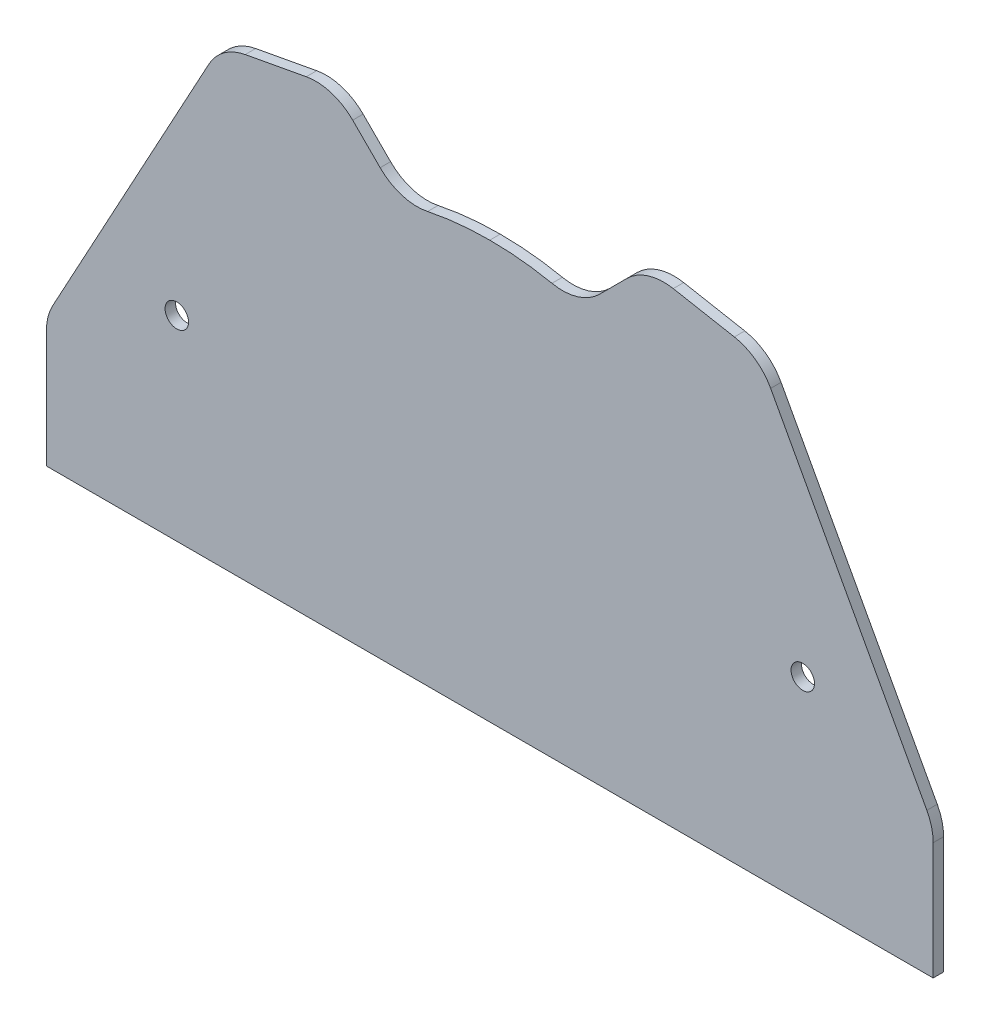
ISO-10303-21;
HEADER;
FILE_DESCRIPTION(('STEP AP214'),'2;1');
FILE_NAME('part.step','',(''),(''),'','','');
FILE_SCHEMA(('AUTOMOTIVE_DESIGN { 1 0 10303 214 1 1 1 1 }'));
ENDSEC;
DATA;
#1=APPLICATION_CONTEXT('core data for automotive mechanical design processes');
#2=APPLICATION_PROTOCOL_DEFINITION('international standard','automotive_design',2000,#1);
#3=PRODUCT_CONTEXT('',#1,'mechanical');
#4=PRODUCT('Part','Part','',(#3));
#5=PRODUCT_RELATED_PRODUCT_CATEGORY('part','',(#4));
#6=PRODUCT_DEFINITION_FORMATION('','',#4);
#7=PRODUCT_DEFINITION_CONTEXT('part definition',#1,'design');
#8=PRODUCT_DEFINITION('design','',#6,#7);
#9=PRODUCT_DEFINITION_SHAPE('','',#8);
#10=(LENGTH_UNIT() NAMED_UNIT(*) SI_UNIT(.MILLI.,.METRE.));
#11=(NAMED_UNIT(*) PLANE_ANGLE_UNIT() SI_UNIT($,.RADIAN.));
#12=(NAMED_UNIT(*) SI_UNIT($,.STERADIAN.) SOLID_ANGLE_UNIT());
#13=UNCERTAINTY_MEASURE_WITH_UNIT(LENGTH_MEASURE(1.E-05),#10,'distance_accuracy_value','');
#14=(GEOMETRIC_REPRESENTATION_CONTEXT(3) GLOBAL_UNCERTAINTY_ASSIGNED_CONTEXT((#13)) GLOBAL_UNIT_ASSIGNED_CONTEXT((#10,
#11,#12)) REPRESENTATION_CONTEXT('',''));
#15=CARTESIAN_POINT('',(0.,0.,0.));
#16=DIRECTION('',(0.,0.,1.));
#17=DIRECTION('',(1.,0.,0.));
#18=AXIS2_PLACEMENT_3D('',#15,#16,#17);
#19=CARTESIAN_POINT('',(-0.186815251095863,22.2203437074519,2.));
#20=DIRECTION('',(0.,0.,-1.));
#21=DIRECTION('',(-1.,0.,0.));
#22=AXIS2_PLACEMENT_3D('',#19,#20,#21);
#23=PLANE('',#22);
#24=CARTESIAN_POINT('',(-60.,37.5,2.));
#25=DIRECTION('',(0.,0.,1.));
#26=DIRECTION('',(1.,0.,0.));
#27=AXIS2_PLACEMENT_3D('',#24,#25,#26);
#28=CIRCLE('',#27,2.25);
#29=CARTESIAN_POINT('',(-57.75,37.5,2.));
#30=VERTEX_POINT('',#29);
#31=EDGE_CURVE('E299',#30,#30,#28,.T.);
#32=ORIENTED_EDGE('',*,*,#31,.F.);
#33=EDGE_LOOP('',(#32));
#34=FACE_BOUND('',#33,.T.);
#35=DIRECTION('',(-0.477610976525833,-0.878571428571428,0.));
#36=VECTOR('',#35,1.);
#37=CARTESIAN_POINT('',(-51.5672316431917,86.5,2.));
#38=LINE('',#37,#36);
#39=CARTESIAN_POINT('',(-53.84344948461,82.3128685081288,2.));
#40=VERTEX_POINT('',#39);
#41=CARTESIAN_POINT('',(-83.7857142857143,27.2336939206341,2.));
#42=VERTEX_POINT('',#41);
#43=EDGE_CURVE('E290',#40,#42,#38,.T.);
#44=ORIENTED_EDGE('',*,*,#43,.T.);
#45=CARTESIAN_POINT('',(-75.,22.4575841553758,2.));
#46=DIRECTION('',(0.,0.,-1.));
#47=DIRECTION('',(-1.,0.,0.));
#48=AXIS2_PLACEMENT_3D('',#45,#46,#47);
#49=CIRCLE('',#48,10.);
#50=CARTESIAN_POINT('',(-85.,22.4575841553758,2.));
#51=VERTEX_POINT('',#50);
#52=EDGE_CURVE('E171',#42,#51,#49,.F.);
#53=ORIENTED_EDGE('',*,*,#52,.T.);
#54=DIRECTION('',(0.,-1.,0.));
#55=VECTOR('',#54,1.);
#56=CARTESIAN_POINT('',(-85.,0.,2.));
#57=LINE('',#56,#55);
#58=CARTESIAN_POINT('',(-85.,0.,2.));
#59=VERTEX_POINT('',#58);
#60=EDGE_CURVE('E163',#51,#59,#57,.T.);
#61=ORIENTED_EDGE('',*,*,#60,.T.);
#62=DIRECTION('',(1.,0.,0.));
#63=VECTOR('',#62,1.);
#64=CARTESIAN_POINT('',(-85.,0.,2.));
#65=LINE('',#64,#63);
#66=CARTESIAN_POINT('',(85.,0.,2.));
#67=VERTEX_POINT('',#66);
#68=EDGE_CURVE('E168',#59,#67,#65,.T.);
#69=ORIENTED_EDGE('',*,*,#68,.T.);
#70=DIRECTION('',(0.,1.,0.));
#71=VECTOR('',#70,1.);
#72=CARTESIAN_POINT('',(85.,0.,2.));
#73=LINE('',#72,#71);
#74=CARTESIAN_POINT('',(85.,22.4575841553758,2.));
#75=VERTEX_POINT('',#74);
#76=EDGE_CURVE('E185',#67,#75,#73,.T.);
#77=ORIENTED_EDGE('',*,*,#76,.T.);
#78=CARTESIAN_POINT('',(75.,22.4575841553758,2.));
#79=DIRECTION('',(0.,0.,-1.));
#80=DIRECTION('',(-1.,0.,0.));
#81=AXIS2_PLACEMENT_3D('',#78,#79,#80);
#82=CIRCLE('',#81,10.);
#83=CARTESIAN_POINT('',(83.7857142857143,27.2336939206341,2.));
#84=VERTEX_POINT('',#83);
#85=EDGE_CURVE('E222',#75,#84,#82,.F.);
#86=ORIENTED_EDGE('',*,*,#85,.T.);
#87=DIRECTION('',(-0.477610976525833,0.878571428571428,0.));
#88=VECTOR('',#87,1.);
#89=CARTESIAN_POINT('',(51.5672316431917,86.5,2.));
#90=LINE('',#89,#88);
#91=CARTESIAN_POINT('',(53.84344948461,82.3128685081288,2.));
#92=VERTEX_POINT('',#91);
#93=EDGE_CURVE('E331',#84,#92,#90,.T.);
#94=ORIENTED_EDGE('',*,*,#93,.T.);
#95=CARTESIAN_POINT('',(45.0577351988957,77.5367587428705,2.));
#96=DIRECTION('',(0.,0.,-1.));
#97=DIRECTION('',(-1.,0.,0.));
#98=AXIS2_PLACEMENT_3D('',#95,#96,#97);
#99=CIRCLE('',#98,10.);
#100=CARTESIAN_POINT('',(46.8813024567745,87.3690831097734,2.));
#101=VERTEX_POINT('',#100);
#102=EDGE_CURVE('E220',#92,#101,#99,.F.);
#103=ORIENTED_EDGE('',*,*,#102,.T.);
#104=DIRECTION('',(-0.98323243669029,0.182356725787878,0.));
#105=VECTOR('',#104,1.);
#106=CARTESIAN_POINT('',(30.,90.5,2.));
#107=LINE('',#106,#105);
#108=CARTESIAN_POINT('',(35.1738098605323,89.5404313458254,2.));
#109=VERTEX_POINT('',#108);
#110=EDGE_CURVE('E334',#101,#109,#107,.T.);
#111=ORIENTED_EDGE('',*,*,#110,.T.);
#112=CARTESIAN_POINT('',(33.3502426026535,79.7081069789225,2.));
#113=DIRECTION('',(0.,0.,-1.));
#114=DIRECTION('',(-1.,0.,0.));
#115=AXIS2_PLACEMENT_3D('',#112,#113,#114);
#116=CIRCLE('',#115,10.);
#117=CARTESIAN_POINT('',(26.279174790788,86.779174790788,2.));
#118=VERTEX_POINT('',#117);
#119=EDGE_CURVE('E218',#109,#118,#116,.F.);
#120=ORIENTED_EDGE('',*,*,#119,.T.);
#121=DIRECTION('',(-0.707106781186548,-0.707106781186547,0.));
#122=VECTOR('',#121,1.);
#123=CARTESIAN_POINT('',(30.,90.5,2.));
#124=LINE('',#123,#122);
#125=CARTESIAN_POINT('',(21.0178401937195,81.5178401937195,2.));
#126=VERTEX_POINT('',#125);
#127=EDGE_CURVE('E339',#118,#126,#124,.T.);
#128=ORIENTED_EDGE('',*,*,#127,.T.);
#129=CARTESIAN_POINT('',(13.946772381854,88.5889080055849,2.));
#130=DIRECTION('',(0.,0.,-1.));
#131=DIRECTION('',(-1.,0.,0.));
#132=AXIS2_PLACEMENT_3D('',#129,#130,#131);
#133=CIRCLE('',#132,10.);
#134=CARTESIAN_POINT('',(11.9166800838141,78.7971397658113,2.));
#135=VERTEX_POINT('',#134);
#136=EDGE_CURVE('E258',#126,#135,#133,.T.);
#137=ORIENTED_EDGE('',*,*,#136,.T.);
#138=CARTESIAN_POINT('',(0.186815251095863,22.2203437074519,2.));
#139=DIRECTION('',(0.,0.,1.));
#140=DIRECTION('',(1.,0.,0.));
#141=AXIS2_PLACEMENT_3D('',#138,#139,#140);
#142=CIRCLE('',#141,57.7799583006343);
#143=CARTESIAN_POINT('',(0.,80.,2.));
#144=VERTEX_POINT('',#143);
#145=EDGE_CURVE('E292',#135,#144,#142,.T.);
#146=ORIENTED_EDGE('',*,*,#145,.T.);
#147=CARTESIAN_POINT('',(-0.186815251095863,22.2203437074519,2.));
#148=DIRECTION('',(0.,0.,1.));
#149=DIRECTION('',(-1.,0.,0.));
#150=AXIS2_PLACEMENT_3D('',#147,#148,#149);
#151=CIRCLE('',#150,57.7799583006343);
#152=CARTESIAN_POINT('',(-11.9166800838141,78.7971397658113,2.));
#153=VERTEX_POINT('',#152);
#154=EDGE_CURVE('E284',#144,#153,#151,.T.);
#155=ORIENTED_EDGE('',*,*,#154,.T.);
#156=CARTESIAN_POINT('',(-13.946772381854,88.5889080055849,2.));
#157=DIRECTION('',(0.,0.,-1.));
#158=DIRECTION('',(-1.,0.,0.));
#159=AXIS2_PLACEMENT_3D('',#156,#157,#158);
#160=CIRCLE('',#159,10.);
#161=CARTESIAN_POINT('',(-21.0178401937195,81.5178401937195,2.));
#162=VERTEX_POINT('',#161);
#163=EDGE_CURVE('E11',#153,#162,#160,.T.);
#164=ORIENTED_EDGE('',*,*,#163,.T.);
#165=DIRECTION('',(-0.707106781186548,0.707106781186547,0.));
#166=VECTOR('',#165,1.);
#167=CARTESIAN_POINT('',(-30.,90.5,2.));
#168=LINE('',#167,#166);
#169=CARTESIAN_POINT('',(-26.279174790788,86.779174790788,2.));
#170=VERTEX_POINT('',#169);
#171=EDGE_CURVE('E283',#162,#170,#168,.T.);
#172=ORIENTED_EDGE('',*,*,#171,.T.);
#173=CARTESIAN_POINT('',(-33.3502426026535,79.7081069789225,2.));
#174=DIRECTION('',(0.,0.,-1.));
#175=DIRECTION('',(-1.,0.,0.));
#176=AXIS2_PLACEMENT_3D('',#173,#174,#175);
#177=CIRCLE('',#176,10.);
#178=CARTESIAN_POINT('',(-35.1738098605323,89.5404313458254,2.));
#179=VERTEX_POINT('',#178);
#180=EDGE_CURVE('E55',#170,#179,#177,.F.);
#181=ORIENTED_EDGE('',*,*,#180,.T.);
#182=DIRECTION('',(-0.98323243669029,-0.182356725787878,0.));
#183=VECTOR('',#182,1.);
#184=CARTESIAN_POINT('',(-30.,90.5,2.));
#185=LINE('',#184,#183);
#186=CARTESIAN_POINT('',(-46.8813024567745,87.3690831097734,2.));
#187=VERTEX_POINT('',#186);
#188=EDGE_CURVE('E288',#179,#187,#185,.T.);
#189=ORIENTED_EDGE('',*,*,#188,.T.);
#190=CARTESIAN_POINT('',(-45.0577351988957,77.5367587428705,2.));
#191=DIRECTION('',(0.,0.,-1.));
#192=DIRECTION('',(-1.,0.,0.));
#193=AXIS2_PLACEMENT_3D('',#190,#191,#192);
#194=CIRCLE('',#193,10.);
#195=EDGE_CURVE('E215',#187,#40,#194,.F.);
#196=ORIENTED_EDGE('',*,*,#195,.T.);
#197=EDGE_LOOP('',(#44,#53,#61,#69,#77,#86,#94,#103,#111,#120,#128,#137,#146,#155,#164,#172,
#181,#189,#196));
#198=FACE_BOUND('',#197,.T.);
#199=CARTESIAN_POINT('',(60.,37.5,2.));
#200=DIRECTION('',(0.,0.,1.));
#201=DIRECTION('',(-1.,0.,0.));
#202=AXIS2_PLACEMENT_3D('',#199,#200,#201);
#203=CIRCLE('',#202,2.25);
#204=CARTESIAN_POINT('',(57.75,37.5,2.));
#205=VERTEX_POINT('',#204);
#206=EDGE_CURVE('E575',#205,#205,#203,.T.);
#207=ORIENTED_EDGE('',*,*,#206,.F.);
#208=EDGE_LOOP('',(#207));
#209=FACE_BOUND('',#208,.T.);
#210=ADVANCED_FACE('F33',(#34,#198,#209),#23,.F.);
#211=CARTESIAN_POINT('',(-0.186815251095863,22.2203437074519,0.));
#212=DIRECTION('',(0.,0.,-1.));
#213=DIRECTION('',(-1.,0.,0.));
#214=AXIS2_PLACEMENT_3D('',#211,#212,#213);
#215=PLANE('',#214);
#216=CARTESIAN_POINT('',(-60.,37.5,0.));
#217=DIRECTION('',(0.,0.,1.));
#218=DIRECTION('',(1.,0.,0.));
#219=AXIS2_PLACEMENT_3D('',#216,#217,#218);
#220=CIRCLE('',#219,2.25);
#221=CARTESIAN_POINT('',(-57.75,37.5,0.));
#222=VERTEX_POINT('',#221);
#223=EDGE_CURVE('E574',#222,#222,#220,.T.);
#224=ORIENTED_EDGE('',*,*,#223,.T.);
#225=EDGE_LOOP('',(#224));
#226=FACE_BOUND('',#225,.T.);
#227=DIRECTION('',(0.,-1.,0.));
#228=VECTOR('',#227,1.);
#229=CARTESIAN_POINT('',(-85.,0.,0.));
#230=LINE('',#229,#228);
#231=CARTESIAN_POINT('',(-85.,22.4575841553758,0.));
#232=VERTEX_POINT('',#231);
#233=CARTESIAN_POINT('',(-85.,0.,0.));
#234=VERTEX_POINT('',#233);
#235=EDGE_CURVE('E189',#232,#234,#230,.T.);
#236=ORIENTED_EDGE('',*,*,#235,.F.);
#237=CARTESIAN_POINT('',(-75.,22.4575841553758,0.));
#238=DIRECTION('',(0.,0.,-1.));
#239=DIRECTION('',(-1.,0.,0.));
#240=AXIS2_PLACEMENT_3D('',#237,#238,#239);
#241=CIRCLE('',#240,10.);
#242=CARTESIAN_POINT('',(-83.7857142857143,27.2336939206341,0.));
#243=VERTEX_POINT('',#242);
#244=EDGE_CURVE('E208',#232,#243,#241,.T.);
#245=ORIENTED_EDGE('',*,*,#244,.T.);
#246=DIRECTION('',(-0.477610976525833,-0.878571428571428,0.));
#247=VECTOR('',#246,1.);
#248=CARTESIAN_POINT('',(-51.5672316431917,86.5,0.));
#249=LINE('',#248,#247);
#250=CARTESIAN_POINT('',(-53.84344948461,82.3128685081288,0.));
#251=VERTEX_POINT('',#250);
#252=EDGE_CURVE('E176',#251,#243,#249,.T.);
#253=ORIENTED_EDGE('',*,*,#252,.F.);
#254=CARTESIAN_POINT('',(-45.0577351988957,77.5367587428705,0.));
#255=DIRECTION('',(0.,0.,-1.));
#256=DIRECTION('',(-1.,0.,0.));
#257=AXIS2_PLACEMENT_3D('',#254,#255,#256);
#258=CIRCLE('',#257,10.);
#259=CARTESIAN_POINT('',(-46.8813024567745,87.3690831097734,0.));
#260=VERTEX_POINT('',#259);
#261=EDGE_CURVE('E193',#251,#260,#258,.T.);
#262=ORIENTED_EDGE('',*,*,#261,.T.);
#263=DIRECTION('',(-0.98323243669029,-0.182356725787878,0.));
#264=VECTOR('',#263,1.);
#265=CARTESIAN_POINT('',(-30.,90.5,0.));
#266=LINE('',#265,#264);
#267=CARTESIAN_POINT('',(-35.1738098605323,89.5404313458254,0.));
#268=VERTEX_POINT('',#267);
#269=EDGE_CURVE('E315',#268,#260,#266,.T.);
#270=ORIENTED_EDGE('',*,*,#269,.F.);
#271=CARTESIAN_POINT('',(-33.3502426026535,79.7081069789225,0.));
#272=DIRECTION('',(0.,0.,-1.));
#273=DIRECTION('',(-1.,0.,0.));
#274=AXIS2_PLACEMENT_3D('',#271,#272,#273);
#275=CIRCLE('',#274,10.);
#276=CARTESIAN_POINT('',(-26.279174790788,86.779174790788,0.));
#277=VERTEX_POINT('',#276);
#278=EDGE_CURVE('E200',#268,#277,#275,.T.);
#279=ORIENTED_EDGE('',*,*,#278,.T.);
#280=DIRECTION('',(-0.707106781186548,0.707106781186547,0.));
#281=VECTOR('',#280,1.);
#282=CARTESIAN_POINT('',(-30.,90.5,0.));
#283=LINE('',#282,#281);
#284=CARTESIAN_POINT('',(-21.0178401937195,81.5178401937195,0.));
#285=VERTEX_POINT('',#284);
#286=EDGE_CURVE('E268',#285,#277,#283,.T.);
#287=ORIENTED_EDGE('',*,*,#286,.F.);
#288=CARTESIAN_POINT('',(-13.946772381854,88.5889080055849,0.));
#289=DIRECTION('',(0.,0.,-1.));
#290=DIRECTION('',(-1.,0.,0.));
#291=AXIS2_PLACEMENT_3D('',#288,#289,#290);
#292=CIRCLE('',#291,10.);
#293=CARTESIAN_POINT('',(-11.9166800838141,78.7971397658113,0.));
#294=VERTEX_POINT('',#293);
#295=EDGE_CURVE('E41',#285,#294,#292,.F.);
#296=ORIENTED_EDGE('',*,*,#295,.T.);
#297=CARTESIAN_POINT('',(-0.186815251095863,22.2203437074519,0.));
#298=DIRECTION('',(0.,0.,1.));
#299=DIRECTION('',(-1.,0.,0.));
#300=AXIS2_PLACEMENT_3D('',#297,#298,#299);
#301=CIRCLE('',#300,57.7799583006343);
#302=CARTESIAN_POINT('',(0.,80.,0.));
#303=VERTEX_POINT('',#302);
#304=EDGE_CURVE('E266',#303,#294,#301,.T.);
#305=ORIENTED_EDGE('',*,*,#304,.F.);
#306=CARTESIAN_POINT('',(0.186815251095863,22.2203437074519,0.));
#307=DIRECTION('',(0.,0.,1.));
#308=DIRECTION('',(1.,0.,0.));
#309=AXIS2_PLACEMENT_3D('',#306,#307,#308);
#310=CIRCLE('',#309,57.7799583006343);
#311=CARTESIAN_POINT('',(11.9166800838141,78.7971397658113,0.));
#312=VERTEX_POINT('',#311);
#313=EDGE_CURVE('E278',#312,#303,#310,.T.);
#314=ORIENTED_EDGE('',*,*,#313,.F.);
#315=CARTESIAN_POINT('',(13.946772381854,88.5889080055849,0.));
#316=DIRECTION('',(0.,0.,-1.));
#317=DIRECTION('',(-1.,0.,0.));
#318=AXIS2_PLACEMENT_3D('',#315,#316,#317);
#319=CIRCLE('',#318,10.);
#320=CARTESIAN_POINT('',(21.0178401937195,81.5178401937195,0.));
#321=VERTEX_POINT('',#320);
#322=EDGE_CURVE('E256',#312,#321,#319,.F.);
#323=ORIENTED_EDGE('',*,*,#322,.T.);
#324=DIRECTION('',(-0.707106781186548,-0.707106781186547,0.));
#325=VECTOR('',#324,1.);
#326=CARTESIAN_POINT('',(30.,90.5,0.));
#327=LINE('',#326,#325);
#328=CARTESIAN_POINT('',(26.279174790788,86.779174790788,0.));
#329=VERTEX_POINT('',#328);
#330=EDGE_CURVE('E310',#329,#321,#327,.T.);
#331=ORIENTED_EDGE('',*,*,#330,.F.);
#332=CARTESIAN_POINT('',(33.3502426026535,79.7081069789225,0.));
#333=DIRECTION('',(0.,0.,-1.));
#334=DIRECTION('',(-1.,0.,0.));
#335=AXIS2_PLACEMENT_3D('',#332,#333,#334);
#336=CIRCLE('',#335,10.);
#337=CARTESIAN_POINT('',(35.1738098605323,89.5404313458254,0.));
#338=VERTEX_POINT('',#337);
#339=EDGE_CURVE('E202',#329,#338,#336,.T.);
#340=ORIENTED_EDGE('',*,*,#339,.T.);
#341=DIRECTION('',(-0.98323243669029,0.182356725787878,0.));
#342=VECTOR('',#341,1.);
#343=CARTESIAN_POINT('',(30.,90.5,0.));
#344=LINE('',#343,#342);
#345=CARTESIAN_POINT('',(46.8813024567745,87.3690831097734,0.));
#346=VERTEX_POINT('',#345);
#347=EDGE_CURVE('E307',#346,#338,#344,.T.);
#348=ORIENTED_EDGE('',*,*,#347,.F.);
#349=CARTESIAN_POINT('',(45.0577351988957,77.5367587428705,0.));
#350=DIRECTION('',(0.,0.,-1.));
#351=DIRECTION('',(-1.,0.,0.));
#352=AXIS2_PLACEMENT_3D('',#349,#350,#351);
#353=CIRCLE('',#352,10.);
#354=CARTESIAN_POINT('',(53.84344948461,82.3128685081288,0.));
#355=VERTEX_POINT('',#354);
#356=EDGE_CURVE('E204',#346,#355,#353,.T.);
#357=ORIENTED_EDGE('',*,*,#356,.T.);
#358=DIRECTION('',(-0.477610976525833,0.878571428571428,0.));
#359=VECTOR('',#358,1.);
#360=CARTESIAN_POINT('',(51.5672316431917,86.5,0.));
#361=LINE('',#360,#359);
#362=CARTESIAN_POINT('',(83.7857142857143,27.2336939206341,0.));
#363=VERTEX_POINT('',#362);
#364=EDGE_CURVE('E304',#363,#355,#361,.T.);
#365=ORIENTED_EDGE('',*,*,#364,.F.);
#366=CARTESIAN_POINT('',(75.,22.4575841553758,0.));
#367=DIRECTION('',(0.,0.,-1.));
#368=DIRECTION('',(-1.,0.,0.));
#369=AXIS2_PLACEMENT_3D('',#366,#367,#368);
#370=CIRCLE('',#369,10.);
#371=CARTESIAN_POINT('',(85.,22.4575841553758,0.));
#372=VERTEX_POINT('',#371);
#373=EDGE_CURVE('E206',#363,#372,#370,.T.);
#374=ORIENTED_EDGE('',*,*,#373,.T.);
#375=DIRECTION('',(0.,1.,0.));
#376=VECTOR('',#375,1.);
#377=CARTESIAN_POINT('',(85.,0.,0.));
#378=LINE('',#377,#376);
#379=CARTESIAN_POINT('',(85.,0.,0.));
#380=VERTEX_POINT('',#379);
#381=EDGE_CURVE('E301',#380,#372,#378,.T.);
#382=ORIENTED_EDGE('',*,*,#381,.F.);
#383=DIRECTION('',(1.,0.,0.));
#384=VECTOR('',#383,1.);
#385=CARTESIAN_POINT('',(-85.,0.,0.));
#386=LINE('',#385,#384);
#387=EDGE_CURVE('E298',#234,#380,#386,.T.);
#388=ORIENTED_EDGE('',*,*,#387,.F.);
#389=EDGE_LOOP('',(#236,#245,#253,#262,#270,#279,#287,#296,#305,#314,#323,#331,#340,#348,#357,
#365,#374,#382,#388));
#390=FACE_BOUND('',#389,.T.);
#391=CARTESIAN_POINT('',(60.,37.5,0.));
#392=DIRECTION('',(0.,0.,1.));
#393=DIRECTION('',(-1.,0.,0.));
#394=AXIS2_PLACEMENT_3D('',#391,#392,#393);
#395=CIRCLE('',#394,2.25);
#396=CARTESIAN_POINT('',(57.75,37.5,0.));
#397=VERTEX_POINT('',#396);
#398=EDGE_CURVE('E579',#397,#397,#395,.T.);
#399=ORIENTED_EDGE('',*,*,#398,.T.);
#400=EDGE_LOOP('',(#399));
#401=FACE_BOUND('',#400,.T.);
#402=ADVANCED_FACE('F263',(#226,#390,#401),#215,.T.);
#403=CARTESIAN_POINT('',(-85.,0.,2.));
#404=DIRECTION('',(1.,0.,0.));
#405=DIRECTION('',(0.,0.,-1.));
#406=AXIS2_PLACEMENT_3D('',#403,#404,#405);
#407=PLANE('',#406);
#408=ORIENTED_EDGE('',*,*,#60,.F.);
#409=DIRECTION('',(0.,0.,-1.));
#410=VECTOR('',#409,1.);
#411=CARTESIAN_POINT('',(-85.,22.4575841553758,2.));
#412=LINE('',#411,#410);
#413=EDGE_CURVE('E191',#51,#232,#412,.T.);
#414=ORIENTED_EDGE('',*,*,#413,.T.);
#415=ORIENTED_EDGE('',*,*,#235,.T.);
#416=DIRECTION('',(0.,0.,-1.));
#417=VECTOR('',#416,1.);
#418=CARTESIAN_POINT('',(-85.,0.,2.));
#419=LINE('',#418,#417);
#420=EDGE_CURVE('E181',#59,#234,#419,.T.);
#421=ORIENTED_EDGE('',*,*,#420,.F.);
#422=EDGE_LOOP('',(#408,#414,#415,#421));
#423=FACE_BOUND('',#422,.T.);
#424=ADVANCED_FACE('F187',(#423),#407,.F.);
#425=CARTESIAN_POINT('',(-85.,0.,2.));
#426=DIRECTION('',(0.,1.,0.));
#427=DIRECTION('',(0.,0.,1.));
#428=AXIS2_PLACEMENT_3D('',#425,#426,#427);
#429=PLANE('',#428);
#430=ORIENTED_EDGE('',*,*,#387,.T.);
#431=DIRECTION('',(0.,0.,-1.));
#432=VECTOR('',#431,1.);
#433=CARTESIAN_POINT('',(85.,0.,2.));
#434=LINE('',#433,#432);
#435=EDGE_CURVE('E183',#67,#380,#434,.T.);
#436=ORIENTED_EDGE('',*,*,#435,.F.);
#437=ORIENTED_EDGE('',*,*,#68,.F.);
#438=ORIENTED_EDGE('',*,*,#420,.T.);
#439=EDGE_LOOP('',(#430,#436,#437,#438));
#440=FACE_BOUND('',#439,.T.);
#441=ADVANCED_FACE('F180',(#440),#429,.F.);
#442=CARTESIAN_POINT('',(85.,0.,2.));
#443=DIRECTION('',(-1.,0.,0.));
#444=DIRECTION('',(0.,0.,1.));
#445=AXIS2_PLACEMENT_3D('',#442,#443,#444);
#446=PLANE('',#445);
#447=ORIENTED_EDGE('',*,*,#381,.T.);
#448=DIRECTION('',(0.,0.,-1.));
#449=VECTOR('',#448,1.);
#450=CARTESIAN_POINT('',(85.,22.4575841553758,2.));
#451=LINE('',#450,#449);
#452=EDGE_CURVE('E230',#372,#75,#451,.F.);
#453=ORIENTED_EDGE('',*,*,#452,.T.);
#454=ORIENTED_EDGE('',*,*,#76,.F.);
#455=ORIENTED_EDGE('',*,*,#435,.T.);
#456=EDGE_LOOP('',(#447,#453,#454,#455));
#457=FACE_BOUND('',#456,.T.);
#458=ADVANCED_FACE('F328',(#457),#446,.F.);
#459=CARTESIAN_POINT('',(51.5672316431917,86.5,2.));
#460=DIRECTION('',(-0.878571428571428,-0.477610976525833,0.));
#461=DIRECTION('',(0.477610976525833,-0.878571428571428,0.));
#462=AXIS2_PLACEMENT_3D('',#459,#460,#461);
#463=PLANE('',#462);
#464=ORIENTED_EDGE('',*,*,#93,.F.);
#465=DIRECTION('',(0.,0.,-1.));
#466=VECTOR('',#465,1.);
#467=CARTESIAN_POINT('',(83.7857142857143,27.2336939206341,2.));
#468=LINE('',#467,#466);
#469=EDGE_CURVE('E227',#84,#363,#468,.T.);
#470=ORIENTED_EDGE('',*,*,#469,.T.);
#471=ORIENTED_EDGE('',*,*,#364,.T.);
#472=DIRECTION('',(0.,0.,-1.));
#473=VECTOR('',#472,1.);
#474=CARTESIAN_POINT('',(53.84344948461,82.3128685081288,2.));
#475=LINE('',#474,#473);
#476=EDGE_CURVE('E225',#355,#92,#475,.F.);
#477=ORIENTED_EDGE('',*,*,#476,.T.);
#478=EDGE_LOOP('',(#464,#470,#471,#477));
#479=FACE_BOUND('',#478,.T.);
#480=ADVANCED_FACE('F395',(#479),#463,.F.);
#481=CARTESIAN_POINT('',(30.,90.5,2.));
#482=DIRECTION('',(-0.182356725787878,-0.98323243669029,0.));
#483=DIRECTION('',(0.98323243669029,-0.182356725787878,0.));
#484=AXIS2_PLACEMENT_3D('',#481,#482,#483);
#485=PLANE('',#484);
#486=ORIENTED_EDGE('',*,*,#110,.F.);
#487=DIRECTION('',(0.,0.,-1.));
#488=VECTOR('',#487,1.);
#489=CARTESIAN_POINT('',(46.8813024567745,87.3690831097734,2.));
#490=LINE('',#489,#488);
#491=EDGE_CURVE('E234',#101,#346,#490,.T.);
#492=ORIENTED_EDGE('',*,*,#491,.T.);
#493=ORIENTED_EDGE('',*,*,#347,.T.);
#494=DIRECTION('',(0.,0.,-1.));
#495=VECTOR('',#494,1.);
#496=CARTESIAN_POINT('',(35.1738098605323,89.5404313458254,2.));
#497=LINE('',#496,#495);
#498=EDGE_CURVE('E232',#338,#109,#497,.F.);
#499=ORIENTED_EDGE('',*,*,#498,.T.);
#500=EDGE_LOOP('',(#486,#492,#493,#499));
#501=FACE_BOUND('',#500,.T.);
#502=ADVANCED_FACE('F392',(#501),#485,.F.);
#503=CARTESIAN_POINT('',(30.,90.5,2.));
#504=DIRECTION('',(0.707106781186547,-0.707106781186548,0.));
#505=DIRECTION('',(0.707106781186548,0.707106781186547,0.));
#506=AXIS2_PLACEMENT_3D('',#503,#504,#505);
#507=PLANE('',#506);
#508=ORIENTED_EDGE('',*,*,#127,.F.);
#509=DIRECTION('',(0.,0.,-1.));
#510=VECTOR('',#509,1.);
#511=CARTESIAN_POINT('',(26.279174790788,86.779174790788,2.));
#512=LINE('',#511,#510);
#513=EDGE_CURVE('E239',#118,#329,#512,.T.);
#514=ORIENTED_EDGE('',*,*,#513,.T.);
#515=ORIENTED_EDGE('',*,*,#330,.T.);
#516=DIRECTION('',(0.,0.,1.));
#517=VECTOR('',#516,1.);
#518=CARTESIAN_POINT('',(21.0178401937195,81.5178401937195,2.));
#519=LINE('',#518,#517);
#520=EDGE_CURVE('E237',#321,#126,#519,.T.);
#521=ORIENTED_EDGE('',*,*,#520,.T.);
#522=EDGE_LOOP('',(#508,#514,#515,#521));
#523=FACE_BOUND('',#522,.T.);
#524=ADVANCED_FACE('F351',(#523),#507,.F.);
#525=CARTESIAN_POINT('',(0.186815251095863,22.2203437074519,2.));
#526=DIRECTION('',(0.,0.,-1.));
#527=DIRECTION('',(-1.,0.,0.));
#528=AXIS2_PLACEMENT_3D('',#525,#526,#527);
#529=CYLINDRICAL_SURFACE('',#528,57.7799583006343);
#530=ORIENTED_EDGE('',*,*,#145,.F.);
#531=DIRECTION('',(0.,0.,-1.));
#532=VECTOR('',#531,1.);
#533=CARTESIAN_POINT('',(11.9166800838141,78.7971397658113,2.));
#534=LINE('',#533,#532);
#535=EDGE_CURVE('E242',#135,#312,#534,.T.);
#536=ORIENTED_EDGE('',*,*,#535,.T.);
#537=ORIENTED_EDGE('',*,*,#313,.T.);
#538=DIRECTION('',(0.,0.,-1.));
#539=VECTOR('',#538,1.);
#540=CARTESIAN_POINT('',(0.,80.,2.));
#541=LINE('',#540,#539);
#542=EDGE_CURVE('E195',#144,#303,#541,.T.);
#543=ORIENTED_EDGE('',*,*,#542,.F.);
#544=EDGE_LOOP('',(#530,#536,#537,#543));
#545=FACE_BOUND('',#544,.T.);
#546=ADVANCED_FACE('F345',(#545),#529,.T.);
#547=CARTESIAN_POINT('',(-0.186815251095863,22.2203437074519,2.));
#548=DIRECTION('',(0.,0.,-1.));
#549=DIRECTION('',(-1.,0.,0.));
#550=AXIS2_PLACEMENT_3D('',#547,#548,#549);
#551=CYLINDRICAL_SURFACE('',#550,57.7799583006343);
#552=ORIENTED_EDGE('',*,*,#304,.T.);
#553=DIRECTION('',(0.,0.,-1.));
#554=VECTOR('',#553,1.);
#555=CARTESIAN_POINT('',(-11.9166800838141,78.7971397658113,2.));
#556=LINE('',#555,#554);
#557=EDGE_CURVE('E250',#294,#153,#556,.F.);
#558=ORIENTED_EDGE('',*,*,#557,.T.);
#559=ORIENTED_EDGE('',*,*,#154,.F.);
#560=ORIENTED_EDGE('',*,*,#542,.T.);
#561=EDGE_LOOP('',(#552,#558,#559,#560));
#562=FACE_BOUND('',#561,.T.);
#563=ADVANCED_FACE('F274',(#562),#551,.T.);
#564=CARTESIAN_POINT('',(-30.,90.5,2.));
#565=DIRECTION('',(-0.707106781186547,-0.707106781186548,0.));
#566=DIRECTION('',(0.707106781186548,-0.707106781186547,0.));
#567=AXIS2_PLACEMENT_3D('',#564,#565,#566);
#568=PLANE('',#567);
#569=ORIENTED_EDGE('',*,*,#171,.F.);
#570=DIRECTION('',(0.,0.,1.));
#571=VECTOR('',#570,1.);
#572=CARTESIAN_POINT('',(-21.0178401937195,81.5178401937195,0.));
#573=LINE('',#572,#571);
#574=EDGE_CURVE('E247',#162,#285,#573,.F.);
#575=ORIENTED_EDGE('',*,*,#574,.T.);
#576=ORIENTED_EDGE('',*,*,#286,.T.);
#577=DIRECTION('',(0.,0.,-1.));
#578=VECTOR('',#577,1.);
#579=CARTESIAN_POINT('',(-26.279174790788,86.779174790788,2.));
#580=LINE('',#579,#578);
#581=EDGE_CURVE('E245',#277,#170,#580,.F.);
#582=ORIENTED_EDGE('',*,*,#581,.T.);
#583=EDGE_LOOP('',(#569,#575,#576,#582));
#584=FACE_BOUND('',#583,.T.);
#585=ADVANCED_FACE('F286',(#584),#568,.F.);
#586=CARTESIAN_POINT('',(-30.,90.5,2.));
#587=DIRECTION('',(0.182356725787878,-0.98323243669029,0.));
#588=DIRECTION('',(0.98323243669029,0.182356725787878,0.));
#589=AXIS2_PLACEMENT_3D('',#586,#587,#588);
#590=PLANE('',#589);
#591=ORIENTED_EDGE('',*,*,#188,.F.);
#592=DIRECTION('',(0.,0.,-1.));
#593=VECTOR('',#592,1.);
#594=CARTESIAN_POINT('',(-35.1738098605323,89.5404313458254,2.));
#595=LINE('',#594,#593);
#596=EDGE_CURVE('E253',#179,#268,#595,.T.);
#597=ORIENTED_EDGE('',*,*,#596,.T.);
#598=ORIENTED_EDGE('',*,*,#269,.T.);
#599=DIRECTION('',(0.,0.,-1.));
#600=VECTOR('',#599,1.);
#601=CARTESIAN_POINT('',(-46.8813024567745,87.3690831097734,2.));
#602=LINE('',#601,#600);
#603=EDGE_CURVE('E48',#260,#187,#602,.F.);
#604=ORIENTED_EDGE('',*,*,#603,.T.);
#605=EDGE_LOOP('',(#591,#597,#598,#604));
#606=FACE_BOUND('',#605,.T.);
#607=ADVANCED_FACE('F381',(#606),#590,.F.);
#608=CARTESIAN_POINT('',(-51.5672316431917,86.5,2.));
#609=DIRECTION('',(0.878571428571428,-0.477610976525833,0.));
#610=DIRECTION('',(0.477610976525833,0.878571428571428,0.));
#611=AXIS2_PLACEMENT_3D('',#608,#609,#610);
#612=PLANE('',#611);
#613=ORIENTED_EDGE('',*,*,#252,.T.);
#614=DIRECTION('',(0.,0.,-1.));
#615=VECTOR('',#614,1.);
#616=CARTESIAN_POINT('',(-83.7857142857143,27.2336939206341,2.));
#617=LINE('',#616,#615);
#618=EDGE_CURVE('E213',#243,#42,#617,.F.);
#619=ORIENTED_EDGE('',*,*,#618,.T.);
#620=ORIENTED_EDGE('',*,*,#43,.F.);
#621=DIRECTION('',(0.,0.,-1.));
#622=VECTOR('',#621,1.);
#623=CARTESIAN_POINT('',(-53.84344948461,82.3128685081288,2.));
#624=LINE('',#623,#622);
#625=EDGE_CURVE('E210',#40,#251,#624,.T.);
#626=ORIENTED_EDGE('',*,*,#625,.T.);
#627=EDGE_LOOP('',(#613,#619,#620,#626));
#628=FACE_BOUND('',#627,.T.);
#629=ADVANCED_FACE('F321',(#628),#612,.F.);
#630=CARTESIAN_POINT('',(-60.,37.5,2.));
#631=DIRECTION('',(0.,0.,-1.));
#632=DIRECTION('',(-1.,0.,0.));
#633=AXIS2_PLACEMENT_3D('',#630,#631,#632);
#634=CYLINDRICAL_SURFACE('',#633,2.25);
#635=ORIENTED_EDGE('',*,*,#31,.T.);
#636=EDGE_LOOP('',(#635));
#637=FACE_BOUND('',#636,.T.);
#638=ORIENTED_EDGE('',*,*,#223,.F.);
#639=EDGE_LOOP('',(#638));
#640=FACE_BOUND('',#639,.T.);
#641=ADVANCED_FACE('F376',(#637,#640),#634,.F.);
#642=CARTESIAN_POINT('',(60.,37.5,2.));
#643=DIRECTION('',(0.,0.,-1.));
#644=DIRECTION('',(-1.,0.,0.));
#645=AXIS2_PLACEMENT_3D('',#642,#643,#644);
#646=CYLINDRICAL_SURFACE('',#645,2.25);
#647=ORIENTED_EDGE('',*,*,#206,.T.);
#648=EDGE_LOOP('',(#647));
#649=FACE_BOUND('',#648,.T.);
#650=ORIENTED_EDGE('',*,*,#398,.F.);
#651=EDGE_LOOP('',(#650));
#652=FACE_BOUND('',#651,.T.);
#653=ADVANCED_FACE('F409',(#649,#652),#646,.F.);
#654=CARTESIAN_POINT('',(-75.,22.4575841553758,2.));
#655=DIRECTION('',(0.,0.,-1.));
#656=DIRECTION('',(-1.,0.,0.));
#657=AXIS2_PLACEMENT_3D('',#654,#655,#656);
#658=CYLINDRICAL_SURFACE('',#657,10.);
#659=ORIENTED_EDGE('',*,*,#52,.F.);
#660=ORIENTED_EDGE('',*,*,#618,.F.);
#661=ORIENTED_EDGE('',*,*,#244,.F.);
#662=ORIENTED_EDGE('',*,*,#413,.F.);
#663=EDGE_LOOP('',(#659,#660,#661,#662));
#664=FACE_BOUND('',#663,.T.);
#665=ADVANCED_FACE('F325',(#664),#658,.T.);
#666=CARTESIAN_POINT('',(75.,22.4575841553758,2.));
#667=DIRECTION('',(0.,0.,-1.));
#668=DIRECTION('',(-1.,0.,0.));
#669=AXIS2_PLACEMENT_3D('',#666,#667,#668);
#670=CYLINDRICAL_SURFACE('',#669,10.);
#671=ORIENTED_EDGE('',*,*,#85,.F.);
#672=ORIENTED_EDGE('',*,*,#452,.F.);
#673=ORIENTED_EDGE('',*,*,#373,.F.);
#674=ORIENTED_EDGE('',*,*,#469,.F.);
#675=EDGE_LOOP('',(#671,#672,#673,#674));
#676=FACE_BOUND('',#675,.T.);
#677=ADVANCED_FACE('F408',(#676),#670,.T.);
#678=CARTESIAN_POINT('',(45.0577351988957,77.5367587428705,2.));
#679=DIRECTION('',(0.,0.,-1.));
#680=DIRECTION('',(-1.,0.,0.));
#681=AXIS2_PLACEMENT_3D('',#678,#679,#680);
#682=CYLINDRICAL_SURFACE('',#681,10.);
#683=ORIENTED_EDGE('',*,*,#102,.F.);
#684=ORIENTED_EDGE('',*,*,#476,.F.);
#685=ORIENTED_EDGE('',*,*,#356,.F.);
#686=ORIENTED_EDGE('',*,*,#491,.F.);
#687=EDGE_LOOP('',(#683,#684,#685,#686));
#688=FACE_BOUND('',#687,.T.);
#689=ADVANCED_FACE('F363',(#688),#682,.T.);
#690=CARTESIAN_POINT('',(33.3502426026535,79.7081069789225,2.));
#691=DIRECTION('',(0.,0.,-1.));
#692=DIRECTION('',(-1.,0.,0.));
#693=AXIS2_PLACEMENT_3D('',#690,#691,#692);
#694=CYLINDRICAL_SURFACE('',#693,10.);
#695=ORIENTED_EDGE('',*,*,#119,.F.);
#696=ORIENTED_EDGE('',*,*,#498,.F.);
#697=ORIENTED_EDGE('',*,*,#339,.F.);
#698=ORIENTED_EDGE('',*,*,#513,.F.);
#699=EDGE_LOOP('',(#695,#696,#697,#698));
#700=FACE_BOUND('',#699,.T.);
#701=ADVANCED_FACE('F355',(#700),#694,.T.);
#702=CARTESIAN_POINT('',(13.946772381854,88.5889080055849,2.));
#703=DIRECTION('',(0.,0.,-1.));
#704=DIRECTION('',(-1.,0.,0.));
#705=AXIS2_PLACEMENT_3D('',#702,#703,#704);
#706=CYLINDRICAL_SURFACE('',#705,10.);
#707=ORIENTED_EDGE('',*,*,#136,.F.);
#708=ORIENTED_EDGE('',*,*,#520,.F.);
#709=ORIENTED_EDGE('',*,*,#322,.F.);
#710=ORIENTED_EDGE('',*,*,#535,.F.);
#711=EDGE_LOOP('',(#707,#708,#709,#710));
#712=FACE_BOUND('',#711,.T.);
#713=ADVANCED_FACE('F353',(#712),#706,.F.);
#714=CARTESIAN_POINT('',(-13.946772381854,88.5889080055849,2.));
#715=DIRECTION('',(0.,0.,-1.));
#716=DIRECTION('',(-1.,0.,0.));
#717=AXIS2_PLACEMENT_3D('',#714,#715,#716);
#718=CYLINDRICAL_SURFACE('',#717,10.);
#719=ORIENTED_EDGE('',*,*,#163,.F.);
#720=ORIENTED_EDGE('',*,*,#557,.F.);
#721=ORIENTED_EDGE('',*,*,#295,.F.);
#722=ORIENTED_EDGE('',*,*,#574,.F.);
#723=EDGE_LOOP('',(#719,#720,#721,#722));
#724=FACE_BOUND('',#723,.T.);
#725=ADVANCED_FACE('F281',(#724),#718,.F.);
#726=CARTESIAN_POINT('',(-33.3502426026535,79.7081069789225,2.));
#727=DIRECTION('',(0.,0.,-1.));
#728=DIRECTION('',(-1.,0.,0.));
#729=AXIS2_PLACEMENT_3D('',#726,#727,#728);
#730=CYLINDRICAL_SURFACE('',#729,10.);
#731=ORIENTED_EDGE('',*,*,#180,.F.);
#732=ORIENTED_EDGE('',*,*,#581,.F.);
#733=ORIENTED_EDGE('',*,*,#278,.F.);
#734=ORIENTED_EDGE('',*,*,#596,.F.);
#735=EDGE_LOOP('',(#731,#732,#733,#734));
#736=FACE_BOUND('',#735,.T.);
#737=ADVANCED_FACE('F361',(#736),#730,.T.);
#738=CARTESIAN_POINT('',(-45.0577351988957,77.5367587428705,2.));
#739=DIRECTION('',(0.,0.,-1.));
#740=DIRECTION('',(-1.,0.,0.));
#741=AXIS2_PLACEMENT_3D('',#738,#739,#740);
#742=CYLINDRICAL_SURFACE('',#741,10.);
#743=ORIENTED_EDGE('',*,*,#195,.F.);
#744=ORIENTED_EDGE('',*,*,#603,.F.);
#745=ORIENTED_EDGE('',*,*,#261,.F.);
#746=ORIENTED_EDGE('',*,*,#625,.F.);
#747=EDGE_LOOP('',(#743,#744,#745,#746));
#748=FACE_BOUND('',#747,.T.);
#749=ADVANCED_FACE('F35',(#748),#742,.T.);
#750=CLOSED_SHELL('',(#210,#402,#424,#441,#458,#480,#502,#524,#546,#563,#585,#607,#629,#641,
#653,#665,#677,#689,#701,#713,#725,#737,#749));
#751=MANIFOLD_SOLID_BREP('B2',#750);
#752=ADVANCED_BREP_SHAPE_REPRESENTATION('',(#18,#751),#14);
#753=SHAPE_DEFINITION_REPRESENTATION(#9,#752);
ENDSEC;
END-ISO-10303-21;
